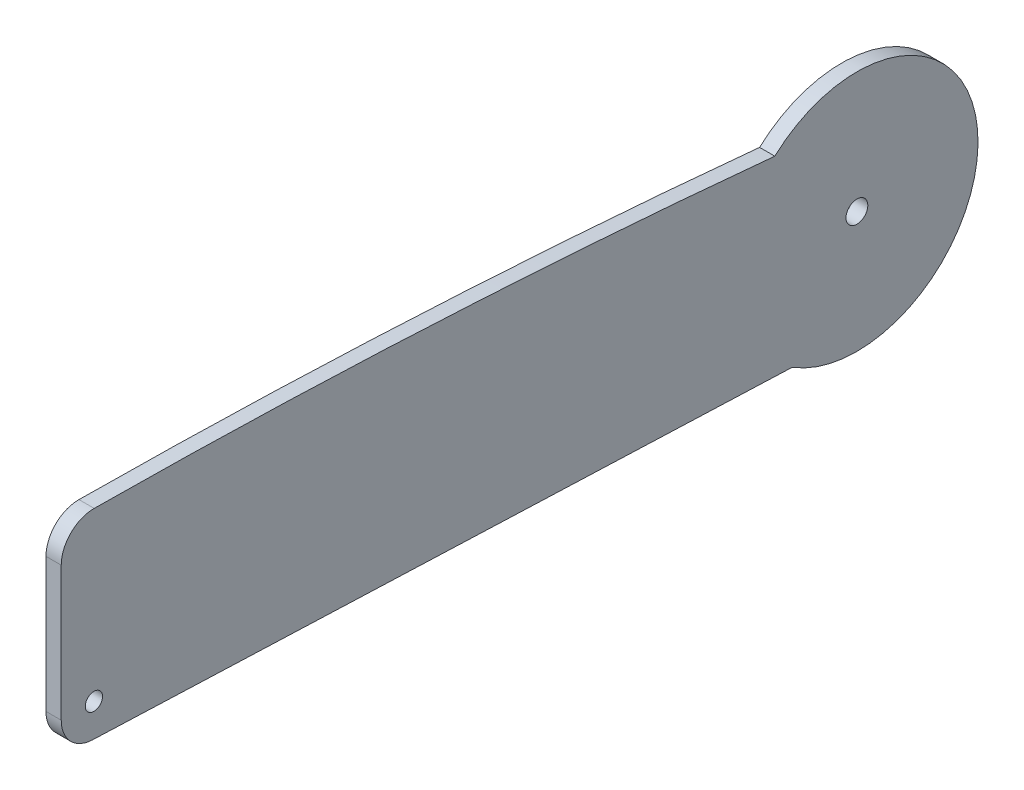
ISO-10303-21;
HEADER;
FILE_DESCRIPTION(('STEP AP214'),'2;1');
FILE_NAME('part.step','',(''),(''),'','','');
FILE_SCHEMA(('AUTOMOTIVE_DESIGN { 1 0 10303 214 1 1 1 1 }'));
ENDSEC;
DATA;
#1=APPLICATION_CONTEXT('core data for automotive mechanical design processes');
#2=APPLICATION_PROTOCOL_DEFINITION('international standard','automotive_design',2000,#1);
#3=PRODUCT_CONTEXT('',#1,'mechanical');
#4=PRODUCT('Part','Part','',(#3));
#5=PRODUCT_RELATED_PRODUCT_CATEGORY('part','',(#4));
#6=PRODUCT_DEFINITION_FORMATION('','',#4);
#7=PRODUCT_DEFINITION_CONTEXT('part definition',#1,'design');
#8=PRODUCT_DEFINITION('design','',#6,#7);
#9=PRODUCT_DEFINITION_SHAPE('','',#8);
#10=(LENGTH_UNIT() NAMED_UNIT(*) SI_UNIT(.MILLI.,.METRE.));
#11=(NAMED_UNIT(*) PLANE_ANGLE_UNIT() SI_UNIT($,.RADIAN.));
#12=(NAMED_UNIT(*) SI_UNIT($,.STERADIAN.) SOLID_ANGLE_UNIT());
#13=UNCERTAINTY_MEASURE_WITH_UNIT(LENGTH_MEASURE(1.E-05),#10,'distance_accuracy_value','');
#14=(GEOMETRIC_REPRESENTATION_CONTEXT(3) GLOBAL_UNCERTAINTY_ASSIGNED_CONTEXT((#13)) GLOBAL_UNIT_ASSIGNED_CONTEXT((#10,
#11,#12)) REPRESENTATION_CONTEXT('',''));
#15=CARTESIAN_POINT('',(0.,0.,0.));
#16=DIRECTION('',(0.,0.,1.));
#17=DIRECTION('',(1.,0.,0.));
#18=AXIS2_PLACEMENT_3D('',#15,#16,#17);
#19=CARTESIAN_POINT('',(5.588,-2797.93492372453,302.139392400577));
#20=DIRECTION('',(-1.,0.,0.));
#21=DIRECTION('',(0.,0.,1.));
#22=AXIS2_PLACEMENT_3D('',#19,#20,#21);
#23=PLANE('',#22);
#24=CARTESIAN_POINT('',(5.588,-2797.93492372453,302.139392400577));
#25=DIRECTION('',(1.,0.,0.));
#26=DIRECTION('',(0.,0.,1.));
#27=AXIS2_PLACEMENT_3D('',#24,#25,#26);
#28=CIRCLE('',#27,2843.65951940497);
#29=CARTESIAN_POINT('',(5.588,32.6847245832902,30.1249278657139));
#30=VERTEX_POINT('',#29);
#31=CARTESIAN_POINT('',(5.588,45.6376789125345,279.906177735358));
#32=VERTEX_POINT('',#31);
#33=EDGE_CURVE('E131',#30,#32,#28,.T.);
#34=ORIENTED_EDGE('',*,*,#33,.T.);
#35=CARTESIAN_POINT('',(5.588,33.6380456938623,280.));
#36=DIRECTION('',(1.,0.,0.));
#37=DIRECTION('',(0.,0.,1.));
#38=AXIS2_PLACEMENT_3D('',#35,#36,#37);
#39=CIRCLE('',#38,12.0000000000002);
#40=CARTESIAN_POINT('',(5.588,33.6380456938623,292.));
#41=VERTEX_POINT('',#40);
#42=EDGE_CURVE('E89',#32,#41,#39,.T.);
#43=ORIENTED_EDGE('',*,*,#42,.T.);
#44=DIRECTION('',(0.,-1.,0.));
#45=VECTOR('',#44,1.);
#46=CARTESIAN_POINT('',(5.588,33.6380456938623,292.));
#47=LINE('',#46,#45);
#48=CARTESIAN_POINT('',(5.588,-15.6483456588356,292.));
#49=VERTEX_POINT('',#48);
#50=EDGE_CURVE('E102',#41,#49,#47,.T.);
#51=ORIENTED_EDGE('',*,*,#50,.T.);
#52=CARTESIAN_POINT('',(5.588,-15.6483456588356,280.));
#53=DIRECTION('',(1.,0.,0.));
#54=DIRECTION('',(0.,0.,-1.));
#55=AXIS2_PLACEMENT_3D('',#52,#53,#54);
#56=CIRCLE('',#55,12.);
#57=CARTESIAN_POINT('',(5.588,-27.6392942563661,280.465995419916));
#58=VERTEX_POINT('',#57);
#59=EDGE_CURVE('E96',#49,#58,#56,.T.);
#60=ORIENTED_EDGE('',*,*,#59,.T.);
#61=DIRECTION('',(0.,-0.0388329516596948,-0.999245716460869));
#62=VECTOR('',#61,1.);
#63=CARTESIAN_POINT('',(5.588,-37.6186648290473,23.677807256581));
#64=LINE('',#63,#62);
#65=CARTESIAN_POINT('',(5.588,-37.6186648290473,23.677807256581));
#66=VERTEX_POINT('',#65);
#67=EDGE_CURVE('E100',#58,#66,#64,.T.);
#68=ORIENTED_EDGE('',*,*,#67,.T.);
#69=CARTESIAN_POINT('',(5.588,0.,0.));
#70=DIRECTION('',(1.,0.,0.));
#71=DIRECTION('',(0.,0.,-1.));
#72=AXIS2_PLACEMENT_3D('',#69,#70,#71);
#73=CIRCLE('',#72,44.45);
#74=EDGE_CURVE('E52',#66,#30,#73,.T.);
#75=ORIENTED_EDGE('',*,*,#74,.T.);
#76=EDGE_LOOP('',(#34,#43,#51,#60,#68,#75));
#77=FACE_BOUND('',#76,.T.);
#78=CARTESIAN_POINT('',(5.588,-15.6483456588356,280.));
#79=DIRECTION('',(1.,0.,0.));
#80=DIRECTION('',(0.,0.,-1.));
#81=AXIS2_PLACEMENT_3D('',#78,#79,#80);
#82=CIRCLE('',#81,3.17499999999997);
#83=CARTESIAN_POINT('',(5.588,-15.6483456588356,276.825));
#84=VERTEX_POINT('',#83);
#85=EDGE_CURVE('E124',#84,#84,#82,.T.);
#86=ORIENTED_EDGE('',*,*,#85,.F.);
#87=EDGE_LOOP('',(#86));
#88=FACE_BOUND('',#87,.T.);
#89=CARTESIAN_POINT('',(5.588,0.,0.));
#90=DIRECTION('',(1.,0.,0.));
#91=DIRECTION('',(0.,0.,-1.));
#92=AXIS2_PLACEMENT_3D('',#89,#90,#91);
#93=CIRCLE('',#92,4.);
#94=CARTESIAN_POINT('',(5.588,0.,-4.));
#95=VERTEX_POINT('',#94);
#96=EDGE_CURVE('E172',#95,#95,#93,.T.);
#97=ORIENTED_EDGE('',*,*,#96,.F.);
#98=EDGE_LOOP('',(#97));
#99=FACE_BOUND('',#98,.T.);
#100=ADVANCED_FACE('F35',(#77,#88,#99),#23,.F.);
#101=CARTESIAN_POINT('',(0.,-2797.93492372453,302.139392400577));
#102=DIRECTION('',(-1.,0.,0.));
#103=DIRECTION('',(0.,0.,1.));
#104=AXIS2_PLACEMENT_3D('',#101,#102,#103);
#105=PLANE('',#104);
#106=CARTESIAN_POINT('',(0.,-15.6483456588356,280.));
#107=DIRECTION('',(1.,0.,0.));
#108=DIRECTION('',(0.,0.,-1.));
#109=AXIS2_PLACEMENT_3D('',#106,#107,#108);
#110=CIRCLE('',#109,3.17499999999997);
#111=CARTESIAN_POINT('',(0.,-15.6483456588356,276.825));
#112=VERTEX_POINT('',#111);
#113=EDGE_CURVE('E177',#112,#112,#110,.T.);
#114=ORIENTED_EDGE('',*,*,#113,.T.);
#115=EDGE_LOOP('',(#114));
#116=FACE_BOUND('',#115,.T.);
#117=CARTESIAN_POINT('',(0.,-2797.93492372453,302.139392400577));
#118=DIRECTION('',(1.,0.,0.));
#119=DIRECTION('',(0.,0.,1.));
#120=AXIS2_PLACEMENT_3D('',#117,#118,#119);
#121=CIRCLE('',#120,2843.65951940497);
#122=CARTESIAN_POINT('',(0.,32.6847245832902,30.1249278657139));
#123=VERTEX_POINT('',#122);
#124=CARTESIAN_POINT('',(0.,45.6376789125345,279.906177735358));
#125=VERTEX_POINT('',#124);
#126=EDGE_CURVE('E120',#123,#125,#121,.T.);
#127=ORIENTED_EDGE('',*,*,#126,.F.);
#128=CARTESIAN_POINT('',(0.,0.,0.));
#129=DIRECTION('',(1.,0.,0.));
#130=DIRECTION('',(0.,0.,-1.));
#131=AXIS2_PLACEMENT_3D('',#128,#129,#130);
#132=CIRCLE('',#131,44.45);
#133=CARTESIAN_POINT('',(0.,-37.6186648290473,23.677807256581));
#134=VERTEX_POINT('',#133);
#135=EDGE_CURVE('E81',#134,#123,#132,.T.);
#136=ORIENTED_EDGE('',*,*,#135,.F.);
#137=DIRECTION('',(0.,-0.0388329516596948,-0.999245716460869));
#138=VECTOR('',#137,1.);
#139=CARTESIAN_POINT('',(0.,-37.6186648290473,23.677807256581));
#140=LINE('',#139,#138);
#141=CARTESIAN_POINT('',(0.,-27.6392942563661,280.465995419916));
#142=VERTEX_POINT('',#141);
#143=EDGE_CURVE('E75',#142,#134,#140,.T.);
#144=ORIENTED_EDGE('',*,*,#143,.F.);
#145=CARTESIAN_POINT('',(0.,-15.6483456588356,280.));
#146=DIRECTION('',(1.,0.,0.));
#147=DIRECTION('',(0.,0.,-1.));
#148=AXIS2_PLACEMENT_3D('',#145,#146,#147);
#149=CIRCLE('',#148,12.);
#150=CARTESIAN_POINT('',(0.,-15.6483456588356,292.));
#151=VERTEX_POINT('',#150);
#152=EDGE_CURVE('E110',#151,#142,#149,.T.);
#153=ORIENTED_EDGE('',*,*,#152,.F.);
#154=DIRECTION('',(0.,-1.,0.));
#155=VECTOR('',#154,1.);
#156=CARTESIAN_POINT('',(0.,33.6380456938623,292.));
#157=LINE('',#156,#155);
#158=CARTESIAN_POINT('',(0.,33.6380456938623,292.));
#159=VERTEX_POINT('',#158);
#160=EDGE_CURVE('E126',#159,#151,#157,.T.);
#161=ORIENTED_EDGE('',*,*,#160,.F.);
#162=CARTESIAN_POINT('',(0.,33.6380456938623,280.));
#163=DIRECTION('',(1.,0.,0.));
#164=DIRECTION('',(0.,0.,1.));
#165=AXIS2_PLACEMENT_3D('',#162,#163,#164);
#166=CIRCLE('',#165,12.0000000000002);
#167=EDGE_CURVE('E123',#125,#159,#166,.T.);
#168=ORIENTED_EDGE('',*,*,#167,.F.);
#169=EDGE_LOOP('',(#127,#136,#144,#153,#161,#168));
#170=FACE_BOUND('',#169,.T.);
#171=CARTESIAN_POINT('',(0.,0.,0.));
#172=DIRECTION('',(1.,0.,0.));
#173=DIRECTION('',(0.,0.,-1.));
#174=AXIS2_PLACEMENT_3D('',#171,#172,#173);
#175=CIRCLE('',#174,4.);
#176=CARTESIAN_POINT('',(0.,0.,-4.));
#177=VERTEX_POINT('',#176);
#178=EDGE_CURVE('E175',#177,#177,#175,.T.);
#179=ORIENTED_EDGE('',*,*,#178,.T.);
#180=EDGE_LOOP('',(#179));
#181=FACE_BOUND('',#180,.T.);
#182=ADVANCED_FACE('F140',(#116,#170,#181),#105,.T.);
#183=CARTESIAN_POINT('',(5.588,-2797.93492372453,302.139392400577));
#184=DIRECTION('',(-1.,0.,0.));
#185=DIRECTION('',(0.,0.,1.));
#186=AXIS2_PLACEMENT_3D('',#183,#184,#185);
#187=CYLINDRICAL_SURFACE('',#186,2843.65951940497);
#188=ORIENTED_EDGE('',*,*,#126,.T.);
#189=DIRECTION('',(-1.,0.,0.));
#190=VECTOR('',#189,1.);
#191=CARTESIAN_POINT('',(5.588,45.6376789125345,279.906177735358));
#192=LINE('',#191,#190);
#193=EDGE_CURVE('E11',#32,#125,#192,.T.);
#194=ORIENTED_EDGE('',*,*,#193,.F.);
#195=ORIENTED_EDGE('',*,*,#33,.F.);
#196=DIRECTION('',(-1.,0.,0.));
#197=VECTOR('',#196,1.);
#198=CARTESIAN_POINT('',(5.588,32.6847245832902,30.1249278657139));
#199=LINE('',#198,#197);
#200=EDGE_CURVE('E116',#30,#123,#199,.T.);
#201=ORIENTED_EDGE('',*,*,#200,.T.);
#202=EDGE_LOOP('',(#188,#194,#195,#201));
#203=FACE_BOUND('',#202,.T.);
#204=ADVANCED_FACE('F37',(#203),#187,.T.);
#205=CARTESIAN_POINT('',(5.588,33.6380456938623,280.));
#206=DIRECTION('',(-1.,0.,0.));
#207=DIRECTION('',(0.,0.,1.));
#208=AXIS2_PLACEMENT_3D('',#205,#206,#207);
#209=CYLINDRICAL_SURFACE('',#208,12.0000000000002);
#210=ORIENTED_EDGE('',*,*,#167,.T.);
#211=DIRECTION('',(-1.,0.,0.));
#212=VECTOR('',#211,1.);
#213=CARTESIAN_POINT('',(5.588,33.6380456938623,292.));
#214=LINE('',#213,#212);
#215=EDGE_CURVE('E44',#41,#159,#214,.T.);
#216=ORIENTED_EDGE('',*,*,#215,.F.);
#217=ORIENTED_EDGE('',*,*,#42,.F.);
#218=ORIENTED_EDGE('',*,*,#193,.T.);
#219=EDGE_LOOP('',(#210,#216,#217,#218));
#220=FACE_BOUND('',#219,.T.);
#221=ADVANCED_FACE('F220',(#220),#209,.T.);
#222=CARTESIAN_POINT('',(5.588,33.6380456938623,292.));
#223=DIRECTION('',(0.,0.,-1.));
#224=DIRECTION('',(-1.,0.,0.));
#225=AXIS2_PLACEMENT_3D('',#222,#223,#224);
#226=PLANE('',#225);
#227=ORIENTED_EDGE('',*,*,#160,.T.);
#228=DIRECTION('',(-1.,0.,0.));
#229=VECTOR('',#228,1.);
#230=CARTESIAN_POINT('',(5.588,-15.6483456588356,292.));
#231=LINE('',#230,#229);
#232=EDGE_CURVE('E111',#49,#151,#231,.T.);
#233=ORIENTED_EDGE('',*,*,#232,.F.);
#234=ORIENTED_EDGE('',*,*,#50,.F.);
#235=ORIENTED_EDGE('',*,*,#215,.T.);
#236=EDGE_LOOP('',(#227,#233,#234,#235));
#237=FACE_BOUND('',#236,.T.);
#238=ADVANCED_FACE('F137',(#237),#226,.F.);
#239=CARTESIAN_POINT('',(5.588,-15.6483456588356,280.));
#240=DIRECTION('',(-1.,0.,0.));
#241=DIRECTION('',(0.,0.,1.));
#242=AXIS2_PLACEMENT_3D('',#239,#240,#241);
#243=CYLINDRICAL_SURFACE('',#242,12.);
#244=ORIENTED_EDGE('',*,*,#152,.T.);
#245=DIRECTION('',(-1.,0.,0.));
#246=VECTOR('',#245,1.);
#247=CARTESIAN_POINT('',(5.588,-27.6392942563661,280.465995419916));
#248=LINE('',#247,#246);
#249=EDGE_CURVE('E107',#58,#142,#248,.T.);
#250=ORIENTED_EDGE('',*,*,#249,.F.);
#251=ORIENTED_EDGE('',*,*,#59,.F.);
#252=ORIENTED_EDGE('',*,*,#232,.T.);
#253=EDGE_LOOP('',(#244,#250,#251,#252));
#254=FACE_BOUND('',#253,.T.);
#255=ADVANCED_FACE('F108',(#254),#243,.T.);
#256=CARTESIAN_POINT('',(5.588,-37.6186648290473,23.677807256581));
#257=DIRECTION('',(0.,0.999245716460869,-0.0388329516596948));
#258=DIRECTION('',(0.,0.0388329516596948,0.999245716460869));
#259=AXIS2_PLACEMENT_3D('',#256,#257,#258);
#260=PLANE('',#259);
#261=ORIENTED_EDGE('',*,*,#143,.T.);
#262=DIRECTION('',(-1.,0.,0.));
#263=VECTOR('',#262,1.);
#264=CARTESIAN_POINT('',(5.588,-37.6186648290473,23.677807256581));
#265=LINE('',#264,#263);
#266=EDGE_CURVE('E112',#66,#134,#265,.T.);
#267=ORIENTED_EDGE('',*,*,#266,.F.);
#268=ORIENTED_EDGE('',*,*,#67,.F.);
#269=ORIENTED_EDGE('',*,*,#249,.T.);
#270=EDGE_LOOP('',(#261,#267,#268,#269));
#271=FACE_BOUND('',#270,.T.);
#272=ADVANCED_FACE('F114',(#271),#260,.F.);
#273=CARTESIAN_POINT('',(5.588,0.,0.));
#274=DIRECTION('',(-1.,0.,0.));
#275=DIRECTION('',(0.,0.,1.));
#276=AXIS2_PLACEMENT_3D('',#273,#274,#275);
#277=CYLINDRICAL_SURFACE('',#276,44.45);
#278=ORIENTED_EDGE('',*,*,#135,.T.);
#279=ORIENTED_EDGE('',*,*,#200,.F.);
#280=ORIENTED_EDGE('',*,*,#74,.F.);
#281=ORIENTED_EDGE('',*,*,#266,.T.);
#282=EDGE_LOOP('',(#278,#279,#280,#281));
#283=FACE_BOUND('',#282,.T.);
#284=ADVANCED_FACE('F145',(#283),#277,.T.);
#285=CARTESIAN_POINT('',(5.588,-15.6483456588356,280.));
#286=DIRECTION('',(-1.,0.,0.));
#287=DIRECTION('',(0.,0.,1.));
#288=AXIS2_PLACEMENT_3D('',#285,#286,#287);
#289=CYLINDRICAL_SURFACE('',#288,3.17499999999997);
#290=ORIENTED_EDGE('',*,*,#85,.T.);
#291=EDGE_LOOP('',(#290));
#292=FACE_BOUND('',#291,.T.);
#293=ORIENTED_EDGE('',*,*,#113,.F.);
#294=EDGE_LOOP('',(#293));
#295=FACE_BOUND('',#294,.T.);
#296=ADVANCED_FACE('F147',(#292,#295),#289,.F.);
#297=CARTESIAN_POINT('',(5.588,0.,0.));
#298=DIRECTION('',(-1.,0.,0.));
#299=DIRECTION('',(0.,0.,1.));
#300=AXIS2_PLACEMENT_3D('',#297,#298,#299);
#301=CYLINDRICAL_SURFACE('',#300,4.);
#302=ORIENTED_EDGE('',*,*,#96,.T.);
#303=EDGE_LOOP('',(#302));
#304=FACE_BOUND('',#303,.T.);
#305=ORIENTED_EDGE('',*,*,#178,.F.);
#306=EDGE_LOOP('',(#305));
#307=FACE_BOUND('',#306,.T.);
#308=ADVANCED_FACE('F153',(#304,#307),#301,.F.);
#309=CLOSED_SHELL('',(#100,#182,#204,#221,#238,#255,#272,#284,#296,#308));
#310=MANIFOLD_SOLID_BREP('B2',#309);
#311=ADVANCED_BREP_SHAPE_REPRESENTATION('',(#18,#310),#14);
#312=SHAPE_DEFINITION_REPRESENTATION(#9,#311);
ENDSEC;
END-ISO-10303-21;
